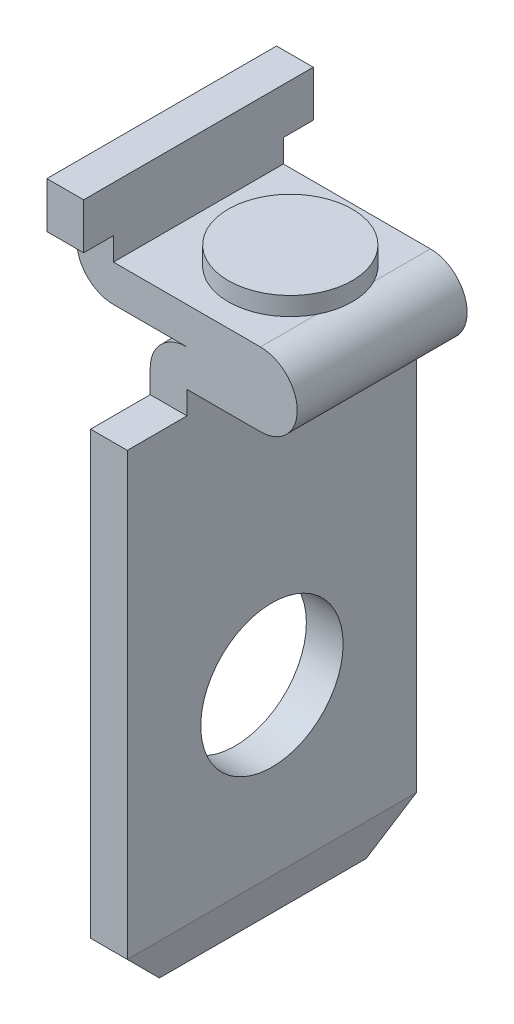
ISO-10303-21;
HEADER;
FILE_DESCRIPTION(('STEP AP214'),'2;1');
FILE_NAME('part.step','',(''),(''),'','','');
FILE_SCHEMA(('AUTOMOTIVE_DESIGN { 1 0 10303 214 1 1 1 1 }'));
ENDSEC;
DATA;
#1=APPLICATION_CONTEXT('core data for automotive mechanical design processes');
#2=APPLICATION_PROTOCOL_DEFINITION('international standard','automotive_design',2000,#1);
#3=PRODUCT_CONTEXT('',#1,'mechanical');
#4=PRODUCT('Part','Part','',(#3));
#5=PRODUCT_RELATED_PRODUCT_CATEGORY('part','',(#4));
#6=PRODUCT_DEFINITION_FORMATION('','',#4);
#7=PRODUCT_DEFINITION_CONTEXT('part definition',#1,'design');
#8=PRODUCT_DEFINITION('design','',#6,#7);
#9=PRODUCT_DEFINITION_SHAPE('','',#8);
#10=(LENGTH_UNIT() NAMED_UNIT(*) SI_UNIT(.MILLI.,.METRE.));
#11=(NAMED_UNIT(*) PLANE_ANGLE_UNIT() SI_UNIT($,.RADIAN.));
#12=(NAMED_UNIT(*) SI_UNIT($,.STERADIAN.) SOLID_ANGLE_UNIT());
#13=UNCERTAINTY_MEASURE_WITH_UNIT(LENGTH_MEASURE(1.E-05),#10,'distance_accuracy_value','');
#14=(GEOMETRIC_REPRESENTATION_CONTEXT(3) GLOBAL_UNCERTAINTY_ASSIGNED_CONTEXT((#13)) GLOBAL_UNIT_ASSIGNED_CONTEXT((#10,
#11,#12)) REPRESENTATION_CONTEXT('',''));
#15=CARTESIAN_POINT('',(0.,0.,0.));
#16=DIRECTION('',(0.,0.,1.));
#17=DIRECTION('',(1.,0.,0.));
#18=AXIS2_PLACEMENT_3D('',#15,#16,#17);
#19=CARTESIAN_POINT('',(-0.8,0.4,0.));
#20=DIRECTION('',(0.,1.,0.));
#21=DIRECTION('',(0.,0.,1.));
#22=AXIS2_PLACEMENT_3D('',#19,#20,#21);
#23=PLANE('',#22);
#24=CARTESIAN_POINT('',(2.,0.4,3.15));
#25=DIRECTION('',(0.,1.,0.));
#26=DIRECTION('',(0.,0.,1.));
#27=AXIS2_PLACEMENT_3D('',#24,#25,#26);
#28=CIRCLE('',#27,1.35);
#29=CARTESIAN_POINT('',(2.,0.4,4.5));
#30=VERTEX_POINT('',#29);
#31=EDGE_CURVE('E251',#30,#30,#28,.F.);
#32=ORIENTED_EDGE('',*,*,#31,.F.);
#33=EDGE_LOOP('',(#32));
#34=FACE_BOUND('',#33,.T.);
#35=ADVANCED_FACE('F16',(#34),#23,.T.);
#36=CARTESIAN_POINT('',(2.,0.,3.15));
#37=DIRECTION('',(0.,1.,0.));
#38=DIRECTION('',(0.,0.,1.));
#39=AXIS2_PLACEMENT_3D('',#36,#37,#38);
#40=CYLINDRICAL_SURFACE('',#39,1.35);
#41=ORIENTED_EDGE('',*,*,#31,.T.);
#42=EDGE_LOOP('',(#41));
#43=FACE_BOUND('',#42,.T.);
#44=CARTESIAN_POINT('',(2.,0.,3.15));
#45=DIRECTION('',(0.,1.,0.));
#46=DIRECTION('',(0.,0.,1.));
#47=AXIS2_PLACEMENT_3D('',#44,#45,#46);
#48=CIRCLE('',#47,1.35);
#49=CARTESIAN_POINT('',(3.2,0.,3.76846584384282));
#50=VERTEX_POINT('',#49);
#51=CARTESIAN_POINT('',(3.2,0.,2.53153415615718));
#52=VERTEX_POINT('',#51);
#53=EDGE_CURVE('E19',#50,#52,#48,.T.);
#54=ORIENTED_EDGE('',*,*,#53,.T.);
#55=CARTESIAN_POINT('',(2.,0.,3.15));
#56=DIRECTION('',(0.,1.,0.));
#57=DIRECTION('',(0.,0.,1.));
#58=AXIS2_PLACEMENT_3D('',#55,#56,#57);
#59=CIRCLE('',#58,1.35);
#60=EDGE_CURVE('E217',#50,#52,#59,.F.);
#61=ORIENTED_EDGE('',*,*,#60,.F.);
#62=EDGE_LOOP('',(#54,#61));
#63=FACE_BOUND('',#62,.T.);
#64=ADVANCED_FACE('F249',(#43,#63),#40,.T.);
#65=CARTESIAN_POINT('',(0.,0.,0.));
#66=DIRECTION('',(1.,0.,0.));
#67=DIRECTION('',(0.,0.,-1.));
#68=AXIS2_PLACEMENT_3D('',#65,#66,#67);
#69=PLANE('',#68);
#70=DIRECTION('',(0.,0.,1.));
#71=VECTOR('',#70,1.);
#72=CARTESIAN_POINT('',(0.,0.,0.));
#73=LINE('',#72,#71);
#74=CARTESIAN_POINT('',(0.,0.,1.3));
#75=VERTEX_POINT('',#74);
#76=CARTESIAN_POINT('',(0.,0.,5.));
#77=VERTEX_POINT('',#76);
#78=EDGE_CURVE('E246',#75,#77,#73,.T.);
#79=ORIENTED_EDGE('',*,*,#78,.F.);
#80=DIRECTION('',(0.,1.,0.));
#81=VECTOR('',#80,1.);
#82=CARTESIAN_POINT('',(0.,0.,1.3));
#83=LINE('',#82,#81);
#84=CARTESIAN_POINT('',(0.,0.5,1.3));
#85=VERTEX_POINT('',#84);
#86=EDGE_CURVE('E247',#75,#85,#83,.T.);
#87=ORIENTED_EDGE('',*,*,#86,.T.);
#88=DIRECTION('',(0.,0.,-1.));
#89=VECTOR('',#88,1.);
#90=CARTESIAN_POINT('',(0.,0.5,0.));
#91=LINE('',#90,#89);
#92=CARTESIAN_POINT('',(0.,0.5,0.65));
#93=VERTEX_POINT('',#92);
#94=EDGE_CURVE('E256',#85,#93,#91,.T.);
#95=ORIENTED_EDGE('',*,*,#94,.T.);
#96=DIRECTION('',(0.,1.,0.));
#97=VECTOR('',#96,1.);
#98=CARTESIAN_POINT('',(0.,0.,0.65));
#99=LINE('',#98,#97);
#100=CARTESIAN_POINT('',(0.,1.5,0.65));
#101=VERTEX_POINT('',#100);
#102=EDGE_CURVE('E262',#93,#101,#99,.T.);
#103=ORIENTED_EDGE('',*,*,#102,.T.);
#104=DIRECTION('',(0.,0.,1.));
#105=VECTOR('',#104,1.);
#106=CARTESIAN_POINT('',(0.,1.5,0.));
#107=LINE('',#106,#105);
#108=CARTESIAN_POINT('',(0.,1.5,5.65));
#109=VERTEX_POINT('',#108);
#110=EDGE_CURVE('E317',#109,#101,#107,.F.);
#111=ORIENTED_EDGE('',*,*,#110,.F.);
#112=DIRECTION('',(0.,1.,0.));
#113=VECTOR('',#112,1.);
#114=CARTESIAN_POINT('',(0.,1.5,5.65));
#115=LINE('',#114,#113);
#116=CARTESIAN_POINT('',(0.,0.5,5.65));
#117=VERTEX_POINT('',#116);
#118=EDGE_CURVE('E307',#109,#117,#115,.F.);
#119=ORIENTED_EDGE('',*,*,#118,.T.);
#120=DIRECTION('',(0.,0.,1.));
#121=VECTOR('',#120,1.);
#122=CARTESIAN_POINT('',(0.,0.5,5.65));
#123=LINE('',#122,#121);
#124=CARTESIAN_POINT('',(0.,0.5,5.));
#125=VERTEX_POINT('',#124);
#126=EDGE_CURVE('E231',#117,#125,#123,.F.);
#127=ORIENTED_EDGE('',*,*,#126,.T.);
#128=DIRECTION('',(0.,1.,0.));
#129=VECTOR('',#128,1.);
#130=CARTESIAN_POINT('',(0.,0.,5.));
#131=LINE('',#130,#129);
#132=EDGE_CURVE('E300',#125,#77,#131,.F.);
#133=ORIENTED_EDGE('',*,*,#132,.T.);
#134=EDGE_LOOP('',(#79,#87,#95,#103,#111,#119,#127,#133));
#135=FACE_BOUND('',#134,.T.);
#136=ADVANCED_FACE('F624',(#135),#69,.T.);
#137=CARTESIAN_POINT('',(3.2,0.,0.));
#138=DIRECTION('',(0.,1.,0.));
#139=DIRECTION('',(0.,0.,1.));
#140=AXIS2_PLACEMENT_3D('',#137,#138,#139);
#141=PLANE('',#140);
#142=DIRECTION('',(0.,0.,1.));
#143=VECTOR('',#142,1.);
#144=CARTESIAN_POINT('',(3.2,0.,0.));
#145=LINE('',#144,#143);
#146=CARTESIAN_POINT('',(3.2,0.,5.));
#147=VERTEX_POINT('',#146);
#148=EDGE_CURVE('E228',#147,#50,#145,.F.);
#149=ORIENTED_EDGE('',*,*,#148,.T.);
#150=ORIENTED_EDGE('',*,*,#60,.T.);
#151=DIRECTION('',(0.,0.,1.));
#152=VECTOR('',#151,1.);
#153=CARTESIAN_POINT('',(3.2,0.,0.));
#154=LINE('',#153,#152);
#155=CARTESIAN_POINT('',(3.2,0.,1.3));
#156=VERTEX_POINT('',#155);
#157=EDGE_CURVE('E225',#52,#156,#154,.F.);
#158=ORIENTED_EDGE('',*,*,#157,.T.);
#159=DIRECTION('',(1.,0.,0.));
#160=VECTOR('',#159,1.);
#161=CARTESIAN_POINT('',(-0.8,0.,1.3));
#162=LINE('',#161,#160);
#163=EDGE_CURVE('E471',#156,#75,#162,.F.);
#164=ORIENTED_EDGE('',*,*,#163,.T.);
#165=ORIENTED_EDGE('',*,*,#78,.T.);
#166=DIRECTION('',(-1.,0.,0.));
#167=VECTOR('',#166,1.);
#168=CARTESIAN_POINT('',(-0.8,0.,5.));
#169=LINE('',#168,#167);
#170=EDGE_CURVE('E411',#77,#147,#169,.F.);
#171=ORIENTED_EDGE('',*,*,#170,.T.);
#172=EDGE_LOOP('',(#149,#150,#158,#164,#165,#171));
#173=FACE_BOUND('',#172,.T.);
#174=ADVANCED_FACE('F222',(#173),#141,.T.);
#175=CARTESIAN_POINT('',(-0.8,0.5,5.65));
#176=DIRECTION('',(0.,1.,0.));
#177=DIRECTION('',(0.,0.,1.));
#178=AXIS2_PLACEMENT_3D('',#175,#176,#177);
#179=PLANE('',#178);
#180=ORIENTED_EDGE('',*,*,#126,.F.);
#181=DIRECTION('',(-1.,0.,0.));
#182=VECTOR('',#181,1.);
#183=CARTESIAN_POINT('',(-0.8,0.5,5.65));
#184=LINE('',#183,#182);
#185=CARTESIAN_POINT('',(-0.8,0.5,5.65));
#186=VERTEX_POINT('',#185);
#187=EDGE_CURVE('E310',#117,#186,#184,.T.);
#188=ORIENTED_EDGE('',*,*,#187,.T.);
#189=DIRECTION('',(0.,0.,1.));
#190=VECTOR('',#189,1.);
#191=CARTESIAN_POINT('',(-0.8,0.5,0.));
#192=LINE('',#191,#190);
#193=CARTESIAN_POINT('',(-0.8,0.5,5.));
#194=VERTEX_POINT('',#193);
#195=EDGE_CURVE('E419',#194,#186,#192,.T.);
#196=ORIENTED_EDGE('',*,*,#195,.F.);
#197=DIRECTION('',(-1.,0.,0.));
#198=VECTOR('',#197,1.);
#199=CARTESIAN_POINT('',(-0.8,0.5,5.));
#200=LINE('',#199,#198);
#201=EDGE_CURVE('E407',#194,#125,#200,.F.);
#202=ORIENTED_EDGE('',*,*,#201,.T.);
#203=EDGE_LOOP('',(#180,#188,#196,#202));
#204=FACE_BOUND('',#203,.T.);
#205=ADVANCED_FACE('F628',(#204),#179,.F.);
#206=CARTESIAN_POINT('',(-0.8,1.5,5.65));
#207=DIRECTION('',(0.,0.,-1.));
#208=DIRECTION('',(-1.,0.,0.));
#209=AXIS2_PLACEMENT_3D('',#206,#207,#208);
#210=PLANE('',#209);
#211=ORIENTED_EDGE('',*,*,#118,.F.);
#212=DIRECTION('',(1.,0.,0.));
#213=VECTOR('',#212,1.);
#214=CARTESIAN_POINT('',(0.,1.5,5.65));
#215=LINE('',#214,#213);
#216=CARTESIAN_POINT('',(-0.8,1.5,5.65));
#217=VERTEX_POINT('',#216);
#218=EDGE_CURVE('E322',#217,#109,#215,.T.);
#219=ORIENTED_EDGE('',*,*,#218,.F.);
#220=DIRECTION('',(0.,1.,0.));
#221=VECTOR('',#220,1.);
#222=CARTESIAN_POINT('',(-0.8,1.5,5.65));
#223=LINE('',#222,#221);
#224=EDGE_CURVE('E426',#186,#217,#223,.T.);
#225=ORIENTED_EDGE('',*,*,#224,.F.);
#226=ORIENTED_EDGE('',*,*,#187,.F.);
#227=EDGE_LOOP('',(#211,#219,#225,#226));
#228=FACE_BOUND('',#227,.T.);
#229=ADVANCED_FACE('F847',(#228),#210,.F.);
#230=CARTESIAN_POINT('',(0.,1.5,0.));
#231=DIRECTION('',(0.,1.,0.));
#232=DIRECTION('',(0.,0.,1.));
#233=AXIS2_PLACEMENT_3D('',#230,#231,#232);
#234=PLANE('',#233);
#235=ORIENTED_EDGE('',*,*,#110,.T.);
#236=DIRECTION('',(1.,0.,0.));
#237=VECTOR('',#236,1.);
#238=CARTESIAN_POINT('',(-0.8,1.5,0.65));
#239=LINE('',#238,#237);
#240=CARTESIAN_POINT('',(-0.8,1.5,0.65));
#241=VERTEX_POINT('',#240);
#242=EDGE_CURVE('E321',#101,#241,#239,.F.);
#243=ORIENTED_EDGE('',*,*,#242,.T.);
#244=DIRECTION('',(0.,0.,1.));
#245=VECTOR('',#244,1.);
#246=CARTESIAN_POINT('',(-0.8,1.5,0.));
#247=LINE('',#246,#245);
#248=EDGE_CURVE('E436',#217,#241,#247,.F.);
#249=ORIENTED_EDGE('',*,*,#248,.F.);
#250=ORIENTED_EDGE('',*,*,#218,.T.);
#251=EDGE_LOOP('',(#235,#243,#249,#250));
#252=FACE_BOUND('',#251,.T.);
#253=ADVANCED_FACE('F838',(#252),#234,.T.);
#254=CARTESIAN_POINT('',(-0.8,0.5,0.65));
#255=DIRECTION('',(0.,0.,1.));
#256=DIRECTION('',(1.,0.,0.));
#257=AXIS2_PLACEMENT_3D('',#254,#255,#256);
#258=PLANE('',#257);
#259=ORIENTED_EDGE('',*,*,#102,.F.);
#260=DIRECTION('',(1.,0.,0.));
#261=VECTOR('',#260,1.);
#262=CARTESIAN_POINT('',(-0.8,0.5,0.65));
#263=LINE('',#262,#261);
#264=CARTESIAN_POINT('',(-0.8,0.5,0.65));
#265=VERTEX_POINT('',#264);
#266=EDGE_CURVE('E412',#93,#265,#263,.F.);
#267=ORIENTED_EDGE('',*,*,#266,.T.);
#268=DIRECTION('',(0.,1.,0.));
#269=VECTOR('',#268,1.);
#270=CARTESIAN_POINT('',(-0.8,1.5,0.65));
#271=LINE('',#270,#269);
#272=EDGE_CURVE('E447',#241,#265,#271,.F.);
#273=ORIENTED_EDGE('',*,*,#272,.F.);
#274=ORIENTED_EDGE('',*,*,#242,.F.);
#275=EDGE_LOOP('',(#259,#267,#273,#274));
#276=FACE_BOUND('',#275,.T.);
#277=ADVANCED_FACE('F829',(#276),#258,.F.);
#278=CARTESIAN_POINT('',(-0.8,0.5,1.3));
#279=DIRECTION('',(0.,1.,0.));
#280=DIRECTION('',(0.,0.,1.));
#281=AXIS2_PLACEMENT_3D('',#278,#279,#280);
#282=PLANE('',#281);
#283=ORIENTED_EDGE('',*,*,#94,.F.);
#284=DIRECTION('',(1.,0.,0.));
#285=VECTOR('',#284,1.);
#286=CARTESIAN_POINT('',(-0.8,0.5,1.3));
#287=LINE('',#286,#285);
#288=CARTESIAN_POINT('',(-0.8,0.5,1.3));
#289=VERTEX_POINT('',#288);
#290=EDGE_CURVE('E420',#85,#289,#287,.F.);
#291=ORIENTED_EDGE('',*,*,#290,.T.);
#292=DIRECTION('',(0.,0.,1.));
#293=VECTOR('',#292,1.);
#294=CARTESIAN_POINT('',(-0.8,0.5,0.));
#295=LINE('',#294,#293);
#296=EDGE_CURVE('E457',#265,#289,#295,.T.);
#297=ORIENTED_EDGE('',*,*,#296,.F.);
#298=ORIENTED_EDGE('',*,*,#266,.F.);
#299=EDGE_LOOP('',(#283,#291,#297,#298));
#300=FACE_BOUND('',#299,.T.);
#301=ADVANCED_FACE('F821',(#300),#282,.F.);
#302=CARTESIAN_POINT('',(-0.8,0.5,5.));
#303=DIRECTION('',(0.,0.,-1.));
#304=DIRECTION('',(-1.,0.,0.));
#305=AXIS2_PLACEMENT_3D('',#302,#303,#304);
#306=PLANE('',#305);
#307=DIRECTION('',(-1.,0.,0.));
#308=VECTOR('',#307,1.);
#309=CARTESIAN_POINT('',(-0.8,-0.8,5.));
#310=LINE('',#309,#308);
#311=CARTESIAN_POINT('',(1.6,-0.8,5.));
#312=VERTEX_POINT('',#311);
#313=CARTESIAN_POINT('',(0.,-0.8,5.));
#314=VERTEX_POINT('',#313);
#315=EDGE_CURVE('E268',#312,#314,#310,.T.);
#316=ORIENTED_EDGE('',*,*,#315,.F.);
#317=CARTESIAN_POINT('',(1.6,-1.6,5.));
#318=DIRECTION('',(0.,0.,1.));
#319=DIRECTION('',(1.,0.,0.));
#320=AXIS2_PLACEMENT_3D('',#317,#318,#319);
#321=CIRCLE('',#320,0.8);
#322=CARTESIAN_POINT('',(0.8,-1.6,5.));
#323=VERTEX_POINT('',#322);
#324=EDGE_CURVE('E265',#323,#312,#321,.F.);
#325=ORIENTED_EDGE('',*,*,#324,.F.);
#326=DIRECTION('',(0.,1.,0.));
#327=VECTOR('',#326,1.);
#328=CARTESIAN_POINT('',(0.8,0.5,5.));
#329=LINE('',#328,#327);
#330=CARTESIAN_POINT('',(0.8,-2.1,5.));
#331=VERTEX_POINT('',#330);
#332=EDGE_CURVE('E269',#331,#323,#329,.T.);
#333=ORIENTED_EDGE('',*,*,#332,.F.);
#334=DIRECTION('',(-1.,0.,0.));
#335=VECTOR('',#334,1.);
#336=CARTESIAN_POINT('',(-0.8,-2.1,5.));
#337=LINE('',#336,#335);
#338=CARTESIAN_POINT('',(1.6,-2.1,5.));
#339=VERTEX_POINT('',#338);
#340=EDGE_CURVE('E333',#339,#331,#337,.T.);
#341=ORIENTED_EDGE('',*,*,#340,.F.);
#342=DIRECTION('',(0.,1.,0.));
#343=VECTOR('',#342,1.);
#344=CARTESIAN_POINT('',(1.6,0.5,5.));
#345=LINE('',#344,#343);
#346=CARTESIAN_POINT('',(1.6,-1.6,5.));
#347=VERTEX_POINT('',#346);
#348=EDGE_CURVE('E330',#347,#339,#345,.F.);
#349=ORIENTED_EDGE('',*,*,#348,.F.);
#350=DIRECTION('',(-1.,0.,0.));
#351=VECTOR('',#350,1.);
#352=CARTESIAN_POINT('',(-0.8,-1.6,5.));
#353=LINE('',#352,#351);
#354=CARTESIAN_POINT('',(3.2,-1.6,5.));
#355=VERTEX_POINT('',#354);
#356=EDGE_CURVE('E334',#355,#347,#353,.T.);
#357=ORIENTED_EDGE('',*,*,#356,.F.);
#358=CARTESIAN_POINT('',(3.2,-0.8,5.));
#359=DIRECTION('',(0.,0.,1.));
#360=DIRECTION('',(1.,0.,0.));
#361=AXIS2_PLACEMENT_3D('',#358,#359,#360);
#362=CIRCLE('',#361,0.8);
#363=EDGE_CURVE('E281',#147,#355,#362,.F.);
#364=ORIENTED_EDGE('',*,*,#363,.F.);
#365=ORIENTED_EDGE('',*,*,#170,.F.);
#366=ORIENTED_EDGE('',*,*,#132,.F.);
#367=ORIENTED_EDGE('',*,*,#201,.F.);
#368=DIRECTION('',(0.,1.,0.));
#369=VECTOR('',#368,1.);
#370=CARTESIAN_POINT('',(-0.8,1.5,5.));
#371=LINE('',#370,#369);
#372=CARTESIAN_POINT('',(-0.8,0.,5.));
#373=VERTEX_POINT('',#372);
#374=EDGE_CURVE('E415',#373,#194,#371,.T.);
#375=ORIENTED_EDGE('',*,*,#374,.F.);
#376=CARTESIAN_POINT('',(0.,0.,5.));
#377=DIRECTION('',(0.,0.,1.));
#378=DIRECTION('',(1.,0.,0.));
#379=AXIS2_PLACEMENT_3D('',#376,#377,#378);
#380=CIRCLE('',#379,0.8);
#381=EDGE_CURVE('E270',#314,#373,#380,.F.);
#382=ORIENTED_EDGE('',*,*,#381,.F.);
#383=EDGE_LOOP('',(#316,#325,#333,#341,#349,#357,#364,#365,#366,#367,#375,#382));
#384=FACE_BOUND('',#383,.T.);
#385=ADVANCED_FACE('F589',(#384),#306,.F.);
#386=CARTESIAN_POINT('',(-0.8,-2.1,1.3));
#387=DIRECTION('',(0.,0.,1.));
#388=DIRECTION('',(1.,0.,0.));
#389=AXIS2_PLACEMENT_3D('',#386,#387,#388);
#390=PLANE('',#389);
#391=ORIENTED_EDGE('',*,*,#86,.F.);
#392=ORIENTED_EDGE('',*,*,#163,.F.);
#393=CARTESIAN_POINT('',(3.2,-0.8,1.3));
#394=DIRECTION('',(0.,0.,1.));
#395=DIRECTION('',(1.,0.,0.));
#396=AXIS2_PLACEMENT_3D('',#393,#394,#395);
#397=CIRCLE('',#396,0.8);
#398=CARTESIAN_POINT('',(3.2,-1.6,1.3));
#399=VERTEX_POINT('',#398);
#400=EDGE_CURVE('E239',#399,#156,#397,.T.);
#401=ORIENTED_EDGE('',*,*,#400,.F.);
#402=DIRECTION('',(1.,0.,0.));
#403=VECTOR('',#402,1.);
#404=CARTESIAN_POINT('',(-0.8,-1.6,1.3));
#405=LINE('',#404,#403);
#406=CARTESIAN_POINT('',(1.6,-1.6,1.3));
#407=VERTEX_POINT('',#406);
#408=EDGE_CURVE('E389',#407,#399,#405,.T.);
#409=ORIENTED_EDGE('',*,*,#408,.F.);
#410=DIRECTION('',(0.,1.,0.));
#411=VECTOR('',#410,1.);
#412=CARTESIAN_POINT('',(1.6,-2.1,1.3));
#413=LINE('',#412,#411);
#414=CARTESIAN_POINT('',(1.6,-2.1,1.3));
#415=VERTEX_POINT('',#414);
#416=EDGE_CURVE('E378',#415,#407,#413,.T.);
#417=ORIENTED_EDGE('',*,*,#416,.F.);
#418=DIRECTION('',(1.,0.,0.));
#419=VECTOR('',#418,1.);
#420=CARTESIAN_POINT('',(-0.8,-2.1,1.3));
#421=LINE('',#420,#419);
#422=CARTESIAN_POINT('',(0.8,-2.1,1.3));
#423=VERTEX_POINT('',#422);
#424=EDGE_CURVE('E375',#423,#415,#421,.T.);
#425=ORIENTED_EDGE('',*,*,#424,.F.);
#426=DIRECTION('',(0.,1.,0.));
#427=VECTOR('',#426,1.);
#428=CARTESIAN_POINT('',(0.8,-2.1,1.3));
#429=LINE('',#428,#427);
#430=CARTESIAN_POINT('',(0.8,-1.6,1.3));
#431=VERTEX_POINT('',#430);
#432=EDGE_CURVE('E280',#431,#423,#429,.F.);
#433=ORIENTED_EDGE('',*,*,#432,.F.);
#434=CARTESIAN_POINT('',(1.6,-1.6,1.3));
#435=DIRECTION('',(0.,0.,1.));
#436=DIRECTION('',(1.,0.,0.));
#437=AXIS2_PLACEMENT_3D('',#434,#435,#436);
#438=CIRCLE('',#437,0.8);
#439=CARTESIAN_POINT('',(1.6,-0.8,1.3));
#440=VERTEX_POINT('',#439);
#441=EDGE_CURVE('E277',#440,#431,#438,.T.);
#442=ORIENTED_EDGE('',*,*,#441,.F.);
#443=DIRECTION('',(1.,0.,0.));
#444=VECTOR('',#443,1.);
#445=CARTESIAN_POINT('',(-0.8,-0.8,1.3));
#446=LINE('',#445,#444);
#447=CARTESIAN_POINT('',(0.,-0.8,1.3));
#448=VERTEX_POINT('',#447);
#449=EDGE_CURVE('E276',#448,#440,#446,.T.);
#450=ORIENTED_EDGE('',*,*,#449,.F.);
#451=CARTESIAN_POINT('',(0.,0.,1.3));
#452=DIRECTION('',(0.,0.,1.));
#453=DIRECTION('',(1.,0.,0.));
#454=AXIS2_PLACEMENT_3D('',#451,#452,#453);
#455=CIRCLE('',#454,0.8);
#456=CARTESIAN_POINT('',(-0.8,0.,1.3));
#457=VERTEX_POINT('',#456);
#458=EDGE_CURVE('E273',#457,#448,#455,.T.);
#459=ORIENTED_EDGE('',*,*,#458,.F.);
#460=DIRECTION('',(0.,1.,0.));
#461=VECTOR('',#460,1.);
#462=CARTESIAN_POINT('',(-0.8,1.5,1.3));
#463=LINE('',#462,#461);
#464=EDGE_CURVE('E285',#289,#457,#463,.F.);
#465=ORIENTED_EDGE('',*,*,#464,.F.);
#466=ORIENTED_EDGE('',*,*,#290,.F.);
#467=EDGE_LOOP('',(#391,#392,#401,#409,#417,#425,#433,#442,#450,#459,#465,#466));
#468=FACE_BOUND('',#467,.T.);
#469=ADVANCED_FACE('F601',(#468),#390,.F.);
#470=CARTESIAN_POINT('',(-0.8,0.,0.));
#471=DIRECTION('',(0.,1.,0.));
#472=DIRECTION('',(0.,0.,1.));
#473=AXIS2_PLACEMENT_3D('',#470,#471,#472);
#474=PLANE('',#473);
#475=DIRECTION('',(0.,0.,1.));
#476=VECTOR('',#475,1.);
#477=CARTESIAN_POINT('',(3.2,0.,0.));
#478=LINE('',#477,#476);
#479=EDGE_CURVE('E234',#52,#50,#478,.T.);
#480=ORIENTED_EDGE('',*,*,#479,.F.);
#481=ORIENTED_EDGE('',*,*,#53,.F.);
#482=EDGE_LOOP('',(#480,#481));
#483=FACE_BOUND('',#482,.T.);
#484=ADVANCED_FACE('F235',(#483),#474,.F.);
#485=CARTESIAN_POINT('',(-0.8,1.5,0.));
#486=DIRECTION('',(-1.,0.,0.));
#487=DIRECTION('',(0.,0.,1.));
#488=AXIS2_PLACEMENT_3D('',#485,#486,#487);
#489=PLANE('',#488);
#490=ORIENTED_EDGE('',*,*,#296,.T.);
#491=ORIENTED_EDGE('',*,*,#464,.T.);
#492=DIRECTION('',(0.,0.,1.));
#493=VECTOR('',#492,1.);
#494=CARTESIAN_POINT('',(-0.8,0.,0.));
#495=LINE('',#494,#493);
#496=EDGE_CURVE('E238',#373,#457,#495,.F.);
#497=ORIENTED_EDGE('',*,*,#496,.F.);
#498=ORIENTED_EDGE('',*,*,#374,.T.);
#499=ORIENTED_EDGE('',*,*,#195,.T.);
#500=ORIENTED_EDGE('',*,*,#224,.T.);
#501=ORIENTED_EDGE('',*,*,#248,.T.);
#502=ORIENTED_EDGE('',*,*,#272,.T.);
#503=EDGE_LOOP('',(#490,#491,#497,#498,#499,#500,#501,#502));
#504=FACE_BOUND('',#503,.T.);
#505=ADVANCED_FACE('F632',(#504),#489,.T.);
#506=CARTESIAN_POINT('',(3.2,-0.8,0.));
#507=DIRECTION('',(0.,0.,1.));
#508=DIRECTION('',(1.,0.,0.));
#509=AXIS2_PLACEMENT_3D('',#506,#507,#508);
#510=CYLINDRICAL_SURFACE('',#509,0.8);
#511=ORIENTED_EDGE('',*,*,#157,.F.);
#512=ORIENTED_EDGE('',*,*,#479,.T.);
#513=ORIENTED_EDGE('',*,*,#148,.F.);
#514=ORIENTED_EDGE('',*,*,#363,.T.);
#515=DIRECTION('',(0.,0.,-1.));
#516=VECTOR('',#515,1.);
#517=CARTESIAN_POINT('',(3.2,-1.6,0.));
#518=LINE('',#517,#516);
#519=EDGE_CURVE('E358',#399,#355,#518,.F.);
#520=ORIENTED_EDGE('',*,*,#519,.F.);
#521=ORIENTED_EDGE('',*,*,#400,.T.);
#522=EDGE_LOOP('',(#511,#512,#513,#514,#520,#521));
#523=FACE_BOUND('',#522,.T.);
#524=ADVANCED_FACE('F242',(#523),#510,.T.);
#525=CARTESIAN_POINT('',(0.,0.,0.));
#526=DIRECTION('',(0.,0.,1.));
#527=DIRECTION('',(1.,0.,0.));
#528=AXIS2_PLACEMENT_3D('',#525,#526,#527);
#529=CYLINDRICAL_SURFACE('',#528,0.8);
#530=ORIENTED_EDGE('',*,*,#496,.T.);
#531=ORIENTED_EDGE('',*,*,#458,.T.);
#532=DIRECTION('',(0.,0.,-1.));
#533=VECTOR('',#532,1.);
#534=CARTESIAN_POINT('',(0.,-0.8,0.));
#535=LINE('',#534,#533);
#536=EDGE_CURVE('E353',#314,#448,#535,.T.);
#537=ORIENTED_EDGE('',*,*,#536,.F.);
#538=ORIENTED_EDGE('',*,*,#381,.T.);
#539=EDGE_LOOP('',(#530,#531,#537,#538));
#540=FACE_BOUND('',#539,.T.);
#541=ADVANCED_FACE('F634',(#540),#529,.T.);
#542=CARTESIAN_POINT('',(1.6,-1.6,0.));
#543=DIRECTION('',(0.,-1.,0.));
#544=DIRECTION('',(0.,0.,-1.));
#545=AXIS2_PLACEMENT_3D('',#542,#543,#544);
#546=PLANE('',#545);
#547=DIRECTION('',(0.,0.,-1.));
#548=VECTOR('',#547,1.);
#549=CARTESIAN_POINT('',(1.6,-1.6,0.));
#550=LINE('',#549,#548);
#551=EDGE_CURVE('E392',#407,#347,#550,.F.);
#552=ORIENTED_EDGE('',*,*,#551,.F.);
#553=ORIENTED_EDGE('',*,*,#408,.T.);
#554=ORIENTED_EDGE('',*,*,#519,.T.);
#555=ORIENTED_EDGE('',*,*,#356,.T.);
#556=EDGE_LOOP('',(#552,#553,#554,#555));
#557=FACE_BOUND('',#556,.T.);
#558=ADVANCED_FACE('F616',(#557),#546,.T.);
#559=CARTESIAN_POINT('',(1.4,-12.6,0.));
#560=DIRECTION('',(0.976187060183946,-0.216930457818688,0.));
#561=DIRECTION('',(0.216930457818688,0.976187060183946,0.));
#562=AXIS2_PLACEMENT_3D('',#559,#560,#561);
#563=PLANE('',#562);
#564=DIRECTION('',(0.,0.,-1.));
#565=VECTOR('',#564,1.);
#566=CARTESIAN_POINT('',(1.4,-12.6,0.));
#567=LINE('',#566,#565);
#568=CARTESIAN_POINT('',(1.4,-12.6,0.9));
#569=VERTEX_POINT('',#568);
#570=CARTESIAN_POINT('',(1.4,-12.6,5.4));
#571=VERTEX_POINT('',#570);
#572=EDGE_CURVE('E357',#569,#571,#567,.F.);
#573=ORIENTED_EDGE('',*,*,#572,.F.);
#574=DIRECTION('',(0.155230105141267,0.698535473135699,-0.6985354731357));
#575=VECTOR('',#574,1.);
#576=CARTESIAN_POINT('',(1.4,-12.6,0.9));
#577=LINE('',#576,#575);
#578=CARTESIAN_POINT('',(1.60000000000001,-11.7,0.));
#579=VERTEX_POINT('',#578);
#580=EDGE_CURVE('E397',#569,#579,#577,.T.);
#581=ORIENTED_EDGE('',*,*,#580,.T.);
#582=DIRECTION('',(0.,0.,-1.));
#583=VECTOR('',#582,1.);
#584=CARTESIAN_POINT('',(1.6,-11.7,0.));
#585=LINE('',#584,#583);
#586=CARTESIAN_POINT('',(1.60000000000001,-11.7,6.3));
#587=VERTEX_POINT('',#586);
#588=EDGE_CURVE('E396',#587,#579,#585,.T.);
#589=ORIENTED_EDGE('',*,*,#588,.F.);
#590=DIRECTION('',(-0.155230105141267,-0.6985354731357,-0.6985354731357));
#591=VECTOR('',#590,1.);
#592=CARTESIAN_POINT('',(1.6,-11.7,6.3));
#593=LINE('',#592,#591);
#594=EDGE_CURVE('E513',#587,#571,#593,.T.);
#595=ORIENTED_EDGE('',*,*,#594,.T.);
#596=EDGE_LOOP('',(#573,#581,#589,#595));
#597=FACE_BOUND('',#596,.T.);
#598=ADVANCED_FACE('F642',(#597),#563,.T.);
#599=CARTESIAN_POINT('',(0.,-0.8,0.));
#600=DIRECTION('',(0.,-1.,0.));
#601=DIRECTION('',(0.,0.,-1.));
#602=AXIS2_PLACEMENT_3D('',#599,#600,#601);
#603=PLANE('',#602);
#604=ORIENTED_EDGE('',*,*,#536,.T.);
#605=ORIENTED_EDGE('',*,*,#449,.T.);
#606=DIRECTION('',(0.,0.,1.));
#607=VECTOR('',#606,1.);
#608=CARTESIAN_POINT('',(1.6,-0.8,0.));
#609=LINE('',#608,#607);
#610=EDGE_CURVE('E341',#312,#440,#609,.F.);
#611=ORIENTED_EDGE('',*,*,#610,.F.);
#612=ORIENTED_EDGE('',*,*,#315,.T.);
#613=EDGE_LOOP('',(#604,#605,#611,#612));
#614=FACE_BOUND('',#613,.T.);
#615=ADVANCED_FACE('F597',(#614),#603,.T.);
#616=CARTESIAN_POINT('',(0.9180269247402,-12.6,0.));
#617=DIRECTION('',(0.,-1.,0.));
#618=DIRECTION('',(0.,0.,-1.));
#619=AXIS2_PLACEMENT_3D('',#616,#617,#618);
#620=PLANE('',#619);
#621=DIRECTION('',(0.,0.,1.));
#622=VECTOR('',#621,1.);
#623=CARTESIAN_POINT('',(0.918026924740179,-12.6,0.));
#624=LINE('',#623,#622);
#625=CARTESIAN_POINT('',(0.918026924740195,-12.6,0.9));
#626=VERTEX_POINT('',#625);
#627=CARTESIAN_POINT('',(0.918026924740195,-12.6,5.4));
#628=VERTEX_POINT('',#627);
#629=EDGE_CURVE('E545',#626,#628,#624,.T.);
#630=ORIENTED_EDGE('',*,*,#629,.F.);
#631=DIRECTION('',(1.,0.,0.));
#632=VECTOR('',#631,1.);
#633=CARTESIAN_POINT('',(0.8,-12.6,0.9));
#634=LINE('',#633,#632);
#635=EDGE_CURVE('E519',#626,#569,#634,.T.);
#636=ORIENTED_EDGE('',*,*,#635,.T.);
#637=ORIENTED_EDGE('',*,*,#572,.T.);
#638=DIRECTION('',(1.,0.,0.));
#639=VECTOR('',#638,1.);
#640=CARTESIAN_POINT('',(0.8,-12.6,5.4));
#641=LINE('',#640,#639);
#642=EDGE_CURVE('E516',#571,#628,#641,.F.);
#643=ORIENTED_EDGE('',*,*,#642,.T.);
#644=EDGE_LOOP('',(#630,#636,#637,#643));
#645=FACE_BOUND('',#644,.T.);
#646=ADVANCED_FACE('F677',(#645),#620,.T.);
#647=CARTESIAN_POINT('',(0.8,-11.7,6.3));
#648=DIRECTION('',(0.,0.707106781186548,-0.707106781186548));
#649=DIRECTION('',(0.,0.707106781186548,0.707106781186548));
#650=AXIS2_PLACEMENT_3D('',#647,#648,#649);
#651=PLANE('',#650);
#652=DIRECTION('',(-0.0923345678501131,0.704086048569326,0.704086048569325));
#653=VECTOR('',#652,1.);
#654=CARTESIAN_POINT('',(0.918026924740179,-12.6,5.4));
#655=LINE('',#654,#653);
#656=CARTESIAN_POINT('',(0.8,-11.7,6.3));
#657=VERTEX_POINT('',#656);
#658=EDGE_CURVE('E549',#628,#657,#655,.T.);
#659=ORIENTED_EDGE('',*,*,#658,.F.);
#660=ORIENTED_EDGE('',*,*,#642,.F.);
#661=ORIENTED_EDGE('',*,*,#594,.F.);
#662=DIRECTION('',(1.,0.,0.));
#663=VECTOR('',#662,1.);
#664=CARTESIAN_POINT('',(0.,-11.7,6.3));
#665=LINE('',#664,#663);
#666=EDGE_CURVE('E531',#657,#587,#665,.T.);
#667=ORIENTED_EDGE('',*,*,#666,.F.);
#668=EDGE_LOOP('',(#659,#660,#661,#667));
#669=FACE_BOUND('',#668,.T.);
#670=ADVANCED_FACE('F573',(#669),#651,.F.);
#671=CARTESIAN_POINT('',(0.8,-12.6,0.9));
#672=DIRECTION('',(0.,0.707106781186548,0.707106781186548));
#673=DIRECTION('',(0.,-0.707106781186548,0.707106781186548));
#674=AXIS2_PLACEMENT_3D('',#671,#672,#673);
#675=PLANE('',#674);
#676=ORIENTED_EDGE('',*,*,#580,.F.);
#677=ORIENTED_EDGE('',*,*,#635,.F.);
#678=DIRECTION('',(0.0923345678501131,-0.704086048569326,0.704086048569324));
#679=VECTOR('',#678,1.);
#680=CARTESIAN_POINT('',(0.8,-11.7,0.));
#681=LINE('',#680,#679);
#682=CARTESIAN_POINT('',(0.8,-11.7,0.));
#683=VERTEX_POINT('',#682);
#684=EDGE_CURVE('E39',#683,#626,#681,.T.);
#685=ORIENTED_EDGE('',*,*,#684,.F.);
#686=DIRECTION('',(1.,0.,0.));
#687=VECTOR('',#686,1.);
#688=CARTESIAN_POINT('',(0.,-11.7,0.));
#689=LINE('',#688,#687);
#690=EDGE_CURVE('E384',#683,#579,#689,.T.);
#691=ORIENTED_EDGE('',*,*,#690,.T.);
#692=EDGE_LOOP('',(#676,#677,#685,#691));
#693=FACE_BOUND('',#692,.T.);
#694=ADVANCED_FACE('F671',(#693),#675,.F.);
#695=CARTESIAN_POINT('',(1.6,-11.7,0.));
#696=DIRECTION('',(1.,0.,0.));
#697=DIRECTION('',(0.,0.,-1.));
#698=AXIS2_PLACEMENT_3D('',#695,#696,#697);
#699=PLANE('',#698);
#700=CARTESIAN_POINT('',(1.6,-8.1,3.15));
#701=DIRECTION('',(1.,0.,0.));
#702=DIRECTION('',(0.,0.,-1.));
#703=AXIS2_PLACEMENT_3D('',#700,#701,#702);
#704=CIRCLE('',#703,1.55);
#705=CARTESIAN_POINT('',(1.6,-8.1,1.6));
#706=VERTEX_POINT('',#705);
#707=EDGE_CURVE('E288',#706,#706,#704,.F.);
#708=ORIENTED_EDGE('',*,*,#707,.T.);
#709=EDGE_LOOP('',(#708));
#710=FACE_BOUND('',#709,.T.);
#711=DIRECTION('',(0.,1.,0.));
#712=VECTOR('',#711,1.);
#713=CARTESIAN_POINT('',(1.6,0.,6.3));
#714=LINE('',#713,#712);
#715=CARTESIAN_POINT('',(1.6,-2.1,6.3));
#716=VERTEX_POINT('',#715);
#717=EDGE_CURVE('E528',#587,#716,#714,.T.);
#718=ORIENTED_EDGE('',*,*,#717,.F.);
#719=ORIENTED_EDGE('',*,*,#588,.T.);
#720=DIRECTION('',(0.,1.,0.));
#721=VECTOR('',#720,1.);
#722=CARTESIAN_POINT('',(1.6,0.,0.));
#723=LINE('',#722,#721);
#724=CARTESIAN_POINT('',(1.6,-2.1,0.));
#725=VERTEX_POINT('',#724);
#726=EDGE_CURVE('E539',#579,#725,#723,.T.);
#727=ORIENTED_EDGE('',*,*,#726,.T.);
#728=DIRECTION('',(0.,0.,-1.));
#729=VECTOR('',#728,1.);
#730=CARTESIAN_POINT('',(1.6,-2.1,0.));
#731=LINE('',#730,#729);
#732=EDGE_CURVE('E362',#725,#415,#731,.F.);
#733=ORIENTED_EDGE('',*,*,#732,.T.);
#734=ORIENTED_EDGE('',*,*,#416,.T.);
#735=ORIENTED_EDGE('',*,*,#551,.T.);
#736=ORIENTED_EDGE('',*,*,#348,.T.);
#737=DIRECTION('',(0.,0.,-1.));
#738=VECTOR('',#737,1.);
#739=CARTESIAN_POINT('',(1.6,-2.1,5.));
#740=LINE('',#739,#738);
#741=EDGE_CURVE('E337',#339,#716,#740,.F.);
#742=ORIENTED_EDGE('',*,*,#741,.T.);
#743=EDGE_LOOP('',(#718,#719,#727,#733,#734,#735,#736,#742));
#744=FACE_BOUND('',#743,.T.);
#745=ADVANCED_FACE('F614',(#710,#744),#699,.T.);
#746=CARTESIAN_POINT('',(0.,0.,6.3));
#747=DIRECTION('',(0.,0.,1.));
#748=DIRECTION('',(1.,0.,0.));
#749=AXIS2_PLACEMENT_3D('',#746,#747,#748);
#750=PLANE('',#749);
#751=DIRECTION('',(0.,1.,0.));
#752=VECTOR('',#751,1.);
#753=CARTESIAN_POINT('',(0.8,-1.6,6.3));
#754=LINE('',#753,#752);
#755=CARTESIAN_POINT('',(0.8,-2.1,6.3));
#756=VERTEX_POINT('',#755);
#757=EDGE_CURVE('E291',#657,#756,#754,.T.);
#758=ORIENTED_EDGE('',*,*,#757,.F.);
#759=ORIENTED_EDGE('',*,*,#666,.T.);
#760=ORIENTED_EDGE('',*,*,#717,.T.);
#761=DIRECTION('',(1.,0.,0.));
#762=VECTOR('',#761,1.);
#763=CARTESIAN_POINT('',(-0.8,-2.1,6.3));
#764=LINE('',#763,#762);
#765=EDGE_CURVE('E342',#716,#756,#764,.F.);
#766=ORIENTED_EDGE('',*,*,#765,.T.);
#767=EDGE_LOOP('',(#758,#759,#760,#766));
#768=FACE_BOUND('',#767,.T.);
#769=ADVANCED_FACE('F576',(#768),#750,.T.);
#770=CARTESIAN_POINT('',(-0.8,-2.1,5.));
#771=DIRECTION('',(0.,-1.,0.));
#772=DIRECTION('',(0.,0.,-1.));
#773=AXIS2_PLACEMENT_3D('',#770,#771,#772);
#774=PLANE('',#773);
#775=ORIENTED_EDGE('',*,*,#340,.T.);
#776=DIRECTION('',(0.,0.,1.));
#777=VECTOR('',#776,1.);
#778=CARTESIAN_POINT('',(0.8,-2.1,0.));
#779=LINE('',#778,#777);
#780=EDGE_CURVE('E349',#756,#331,#779,.F.);
#781=ORIENTED_EDGE('',*,*,#780,.F.);
#782=ORIENTED_EDGE('',*,*,#765,.F.);
#783=ORIENTED_EDGE('',*,*,#741,.F.);
#784=EDGE_LOOP('',(#775,#781,#782,#783));
#785=FACE_BOUND('',#784,.T.);
#786=ADVANCED_FACE('F582',(#785),#774,.F.);
#787=CARTESIAN_POINT('',(1.6,-1.6,0.));
#788=DIRECTION('',(0.,0.,1.));
#789=DIRECTION('',(1.,0.,0.));
#790=AXIS2_PLACEMENT_3D('',#787,#788,#789);
#791=CYLINDRICAL_SURFACE('',#790,0.8);
#792=ORIENTED_EDGE('',*,*,#610,.T.);
#793=ORIENTED_EDGE('',*,*,#441,.T.);
#794=DIRECTION('',(0.,0.,1.));
#795=VECTOR('',#794,1.);
#796=CARTESIAN_POINT('',(0.8,-1.6,0.));
#797=LINE('',#796,#795);
#798=EDGE_CURVE('E352',#323,#431,#797,.F.);
#799=ORIENTED_EDGE('',*,*,#798,.F.);
#800=ORIENTED_EDGE('',*,*,#324,.T.);
#801=EDGE_LOOP('',(#792,#793,#799,#800));
#802=FACE_BOUND('',#801,.T.);
#803=ADVANCED_FACE('F594',(#802),#791,.T.);
#804=CARTESIAN_POINT('',(-0.8,-2.1,0.));
#805=DIRECTION('',(0.,-1.,0.));
#806=DIRECTION('',(0.,0.,-1.));
#807=AXIS2_PLACEMENT_3D('',#804,#805,#806);
#808=PLANE('',#807);
#809=ORIENTED_EDGE('',*,*,#424,.T.);
#810=ORIENTED_EDGE('',*,*,#732,.F.);
#811=DIRECTION('',(1.,0.,0.));
#812=VECTOR('',#811,1.);
#813=CARTESIAN_POINT('',(0.,-2.1,0.));
#814=LINE('',#813,#812);
#815=CARTESIAN_POINT('',(0.8,-2.1,0.));
#816=VERTEX_POINT('',#815);
#817=EDGE_CURVE('E542',#725,#816,#814,.F.);
#818=ORIENTED_EDGE('',*,*,#817,.T.);
#819=DIRECTION('',(0.,0.,1.));
#820=VECTOR('',#819,1.);
#821=CARTESIAN_POINT('',(0.8,-2.1,0.));
#822=LINE('',#821,#820);
#823=EDGE_CURVE('E366',#423,#816,#822,.F.);
#824=ORIENTED_EDGE('',*,*,#823,.F.);
#825=EDGE_LOOP('',(#809,#810,#818,#824));
#826=FACE_BOUND('',#825,.T.);
#827=ADVANCED_FACE('F607',(#826),#808,.F.);
#828=CARTESIAN_POINT('',(0.,0.,0.));
#829=DIRECTION('',(0.,0.,1.));
#830=DIRECTION('',(1.,0.,0.));
#831=AXIS2_PLACEMENT_3D('',#828,#829,#830);
#832=PLANE('',#831);
#833=ORIENTED_EDGE('',*,*,#817,.F.);
#834=ORIENTED_EDGE('',*,*,#726,.F.);
#835=ORIENTED_EDGE('',*,*,#690,.F.);
#836=DIRECTION('',(0.,1.,0.));
#837=VECTOR('',#836,1.);
#838=CARTESIAN_POINT('',(0.8,-1.6,0.));
#839=LINE('',#838,#837);
#840=EDGE_CURVE('E372',#816,#683,#839,.F.);
#841=ORIENTED_EDGE('',*,*,#840,.F.);
#842=EDGE_LOOP('',(#833,#834,#835,#841));
#843=FACE_BOUND('',#842,.T.);
#844=ADVANCED_FACE('F658',(#843),#832,.F.);
#845=CARTESIAN_POINT('',(0.8,-11.7,0.));
#846=DIRECTION('',(-0.991510363236387,-0.130027687800898,0.));
#847=DIRECTION('',(0.130027687800898,-0.991510363236387,0.));
#848=AXIS2_PLACEMENT_3D('',#845,#846,#847);
#849=PLANE('',#848);
#850=DIRECTION('',(0.,0.,1.));
#851=VECTOR('',#850,1.);
#852=CARTESIAN_POINT('',(0.8,-11.7,0.));
#853=LINE('',#852,#851);
#854=EDGE_CURVE('E26',#683,#657,#853,.T.);
#855=ORIENTED_EDGE('',*,*,#854,.F.);
#856=ORIENTED_EDGE('',*,*,#684,.T.);
#857=ORIENTED_EDGE('',*,*,#629,.T.);
#858=ORIENTED_EDGE('',*,*,#658,.T.);
#859=EDGE_LOOP('',(#855,#856,#857,#858));
#860=FACE_BOUND('',#859,.T.);
#861=ADVANCED_FACE('F569',(#860),#849,.T.);
#862=CARTESIAN_POINT('',(0.8,-8.1,3.15));
#863=DIRECTION('',(1.,0.,0.));
#864=DIRECTION('',(0.,0.,-1.));
#865=AXIS2_PLACEMENT_3D('',#862,#863,#864);
#866=CYLINDRICAL_SURFACE('',#865,1.55);
#867=ORIENTED_EDGE('',*,*,#707,.F.);
#868=EDGE_LOOP('',(#867));
#869=FACE_BOUND('',#868,.T.);
#870=CARTESIAN_POINT('',(0.8,-8.1,3.15));
#871=DIRECTION('',(1.,0.,0.));
#872=DIRECTION('',(0.,0.,-1.));
#873=AXIS2_PLACEMENT_3D('',#870,#871,#872);
#874=CIRCLE('',#873,1.55);
#875=CARTESIAN_POINT('',(0.8,-8.1,1.6));
#876=VERTEX_POINT('',#875);
#877=EDGE_CURVE('E11',#876,#876,#874,.T.);
#878=ORIENTED_EDGE('',*,*,#877,.F.);
#879=EDGE_LOOP('',(#878));
#880=FACE_BOUND('',#879,.T.);
#881=ADVANCED_FACE('F646',(#869,#880),#866,.F.);
#882=CARTESIAN_POINT('',(0.8,-1.6,0.));
#883=DIRECTION('',(-1.,0.,0.));
#884=DIRECTION('',(0.,0.,1.));
#885=AXIS2_PLACEMENT_3D('',#882,#883,#884);
#886=PLANE('',#885);
#887=ORIENTED_EDGE('',*,*,#877,.T.);
#888=EDGE_LOOP('',(#887));
#889=FACE_BOUND('',#888,.T.);
#890=ORIENTED_EDGE('',*,*,#840,.T.);
#891=ORIENTED_EDGE('',*,*,#854,.T.);
#892=ORIENTED_EDGE('',*,*,#757,.T.);
#893=ORIENTED_EDGE('',*,*,#780,.T.);
#894=ORIENTED_EDGE('',*,*,#332,.T.);
#895=ORIENTED_EDGE('',*,*,#798,.T.);
#896=ORIENTED_EDGE('',*,*,#432,.T.);
#897=ORIENTED_EDGE('',*,*,#823,.T.);
#898=EDGE_LOOP('',(#890,#891,#892,#893,#894,#895,#896,#897));
#899=FACE_BOUND('',#898,.T.);
#900=ADVANCED_FACE('F565',(#889,#899),#886,.T.);
#901=CLOSED_SHELL('',(#35,#64,#136,#174,#205,#229,#253,#277,#301,#385,#469,#484,#505,#524,#541,
#558,#598,#615,#646,#670,#694,#745,#769,#786,#803,#827,#844,#861,#881,#900));
#902=MANIFOLD_SOLID_BREP('B1',#901);
#903=ADVANCED_BREP_SHAPE_REPRESENTATION('',(#18,#902),#14);
#904=SHAPE_DEFINITION_REPRESENTATION(#9,#903);
ENDSEC;
END-ISO-10303-21;
